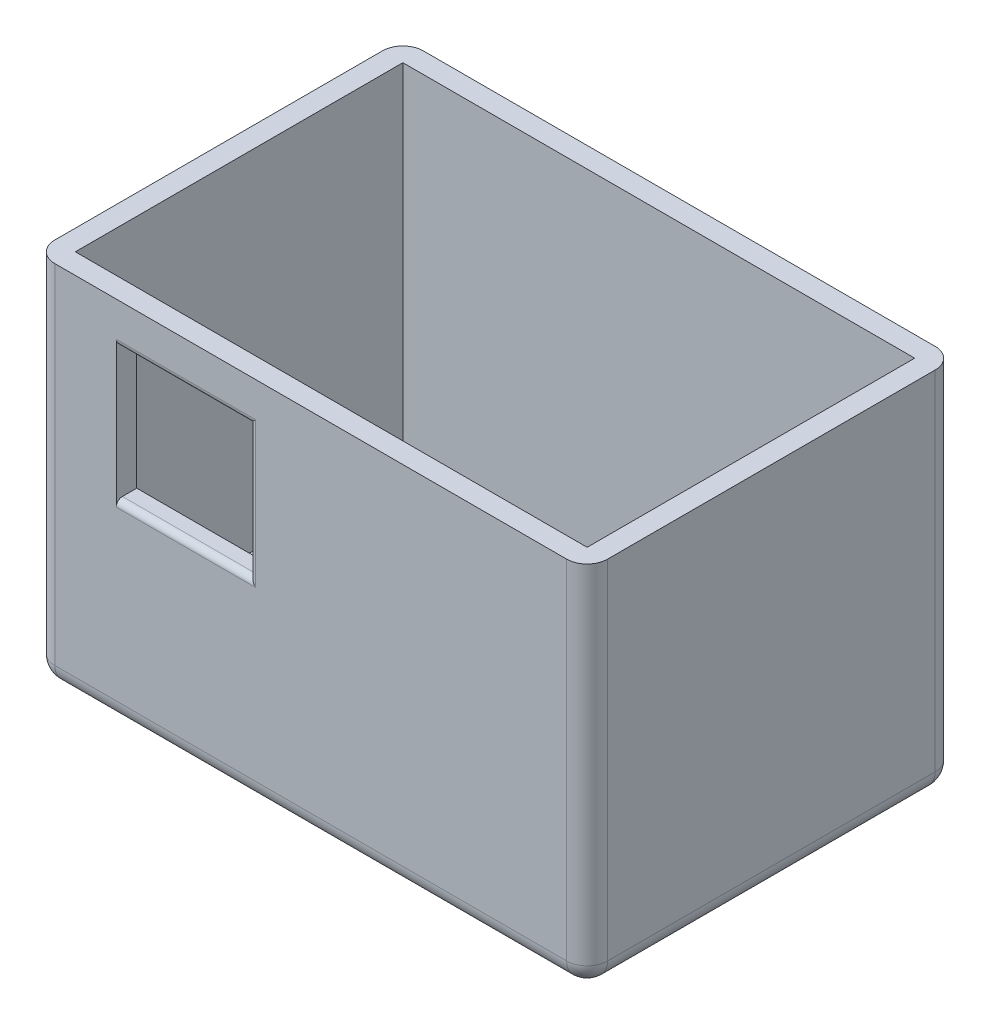
ISO-10303-21;
HEADER;
FILE_DESCRIPTION(('STEP AP214'),'2;1');
FILE_NAME('part.step','',(''),(''),'','','');
FILE_SCHEMA(('AUTOMOTIVE_DESIGN { 1 0 10303 214 1 1 1 1 }'));
ENDSEC;
DATA;
#1=APPLICATION_CONTEXT('core data for automotive mechanical design processes');
#2=APPLICATION_PROTOCOL_DEFINITION('international standard','automotive_design',2000,#1);
#3=PRODUCT_CONTEXT('',#1,'mechanical');
#4=PRODUCT('Part','Part','',(#3));
#5=PRODUCT_RELATED_PRODUCT_CATEGORY('part','',(#4));
#6=PRODUCT_DEFINITION_FORMATION('','',#4);
#7=PRODUCT_DEFINITION_CONTEXT('part definition',#1,'design');
#8=PRODUCT_DEFINITION('design','',#6,#7);
#9=PRODUCT_DEFINITION_SHAPE('','',#8);
#10=(LENGTH_UNIT() NAMED_UNIT(*) SI_UNIT(.MILLI.,.METRE.));
#11=(NAMED_UNIT(*) PLANE_ANGLE_UNIT() SI_UNIT($,.RADIAN.));
#12=(NAMED_UNIT(*) SI_UNIT($,.STERADIAN.) SOLID_ANGLE_UNIT());
#13=UNCERTAINTY_MEASURE_WITH_UNIT(LENGTH_MEASURE(1.E-05),#10,'distance_accuracy_value','');
#14=(GEOMETRIC_REPRESENTATION_CONTEXT(3) GLOBAL_UNCERTAINTY_ASSIGNED_CONTEXT((#13)) GLOBAL_UNIT_ASSIGNED_CONTEXT((#10,
#11,#12)) REPRESENTATION_CONTEXT('',''));
#15=CARTESIAN_POINT('',(0.,0.,0.));
#16=DIRECTION('',(0.,0.,1.));
#17=DIRECTION('',(1.,0.,0.));
#18=AXIS2_PLACEMENT_3D('',#15,#16,#17);
#19=CARTESIAN_POINT('',(0.,180.,0.));
#20=DIRECTION('',(0.,-1.,0.));
#21=DIRECTION('',(0.,0.,-1.));
#22=AXIS2_PLACEMENT_3D('',#19,#20,#21);
#23=PLANE('',#22);
#24=DIRECTION('',(1.,0.,0.));
#25=VECTOR('',#24,1.);
#26=CARTESIAN_POINT('',(-135.,180.,90.));
#27=LINE('',#26,#25);
#28=CARTESIAN_POINT('',(-125.,180.,90.));
#29=VERTEX_POINT('',#28);
#30=CARTESIAN_POINT('',(125.,180.,90.));
#31=VERTEX_POINT('',#30);
#32=EDGE_CURVE('E274',#29,#31,#27,.T.);
#33=ORIENTED_EDGE('',*,*,#32,.T.);
#34=CARTESIAN_POINT('',(125.,180.,80.));
#35=DIRECTION('',(0.,-1.,0.));
#36=DIRECTION('',(0.,0.,-1.));
#37=AXIS2_PLACEMENT_3D('',#34,#35,#36);
#38=CIRCLE('',#37,10.);
#39=CARTESIAN_POINT('',(135.,180.,80.));
#40=VERTEX_POINT('',#39);
#41=EDGE_CURVE('E189',#31,#40,#38,.F.);
#42=ORIENTED_EDGE('',*,*,#41,.T.);
#43=DIRECTION('',(0.,0.,-1.));
#44=VECTOR('',#43,1.);
#45=CARTESIAN_POINT('',(135.,180.,90.));
#46=LINE('',#45,#44);
#47=CARTESIAN_POINT('',(135.,180.,-79.9999999999999));
#48=VERTEX_POINT('',#47);
#49=EDGE_CURVE('E264',#40,#48,#46,.T.);
#50=ORIENTED_EDGE('',*,*,#49,.T.);
#51=CARTESIAN_POINT('',(125.,180.,-80.));
#52=DIRECTION('',(0.,-1.,0.));
#53=DIRECTION('',(0.,0.,-1.));
#54=AXIS2_PLACEMENT_3D('',#51,#52,#53);
#55=CIRCLE('',#54,10.);
#56=CARTESIAN_POINT('',(125.,180.,-90.));
#57=VERTEX_POINT('',#56);
#58=EDGE_CURVE('E315',#48,#57,#55,.F.);
#59=ORIENTED_EDGE('',*,*,#58,.T.);
#60=DIRECTION('',(-1.,0.,0.));
#61=VECTOR('',#60,1.);
#62=CARTESIAN_POINT('',(-135.,180.,-90.));
#63=LINE('',#62,#61);
#64=CARTESIAN_POINT('',(-125.,180.,-90.));
#65=VERTEX_POINT('',#64);
#66=EDGE_CURVE('E267',#57,#65,#63,.T.);
#67=ORIENTED_EDGE('',*,*,#66,.T.);
#68=CARTESIAN_POINT('',(-125.,180.,-80.));
#69=DIRECTION('',(0.,-1.,0.));
#70=DIRECTION('',(0.,0.,-1.));
#71=AXIS2_PLACEMENT_3D('',#68,#69,#70);
#72=CIRCLE('',#71,10.);
#73=CARTESIAN_POINT('',(-135.,180.,-79.9999999999999));
#74=VERTEX_POINT('',#73);
#75=EDGE_CURVE('E313',#65,#74,#72,.F.);
#76=ORIENTED_EDGE('',*,*,#75,.T.);
#77=DIRECTION('',(0.,0.,1.));
#78=VECTOR('',#77,1.);
#79=CARTESIAN_POINT('',(-135.,180.,90.));
#80=LINE('',#79,#78);
#81=CARTESIAN_POINT('',(-135.,180.,80.));
#82=VERTEX_POINT('',#81);
#83=EDGE_CURVE('E271',#74,#82,#80,.T.);
#84=ORIENTED_EDGE('',*,*,#83,.T.);
#85=CARTESIAN_POINT('',(-125.,180.,80.));
#86=DIRECTION('',(0.,-1.,0.));
#87=DIRECTION('',(0.,0.,-1.));
#88=AXIS2_PLACEMENT_3D('',#85,#86,#87);
#89=CIRCLE('',#88,10.);
#90=EDGE_CURVE('E311',#82,#29,#89,.F.);
#91=ORIENTED_EDGE('',*,*,#90,.T.);
#92=EDGE_LOOP('',(#33,#42,#50,#59,#67,#76,#84,#91));
#93=FACE_BOUND('',#92,.T.);
#94=DIRECTION('',(1.,0.,0.));
#95=VECTOR('',#94,1.);
#96=CARTESIAN_POINT('',(0.,180.,80.));
#97=LINE('',#96,#95);
#98=CARTESIAN_POINT('',(-125.,180.,80.));
#99=VERTEX_POINT('',#98);
#100=CARTESIAN_POINT('',(125.,180.,80.));
#101=VERTEX_POINT('',#100);
#102=EDGE_CURVE('E252',#99,#101,#97,.T.);
#103=ORIENTED_EDGE('',*,*,#102,.F.);
#104=DIRECTION('',(0.,0.,1.));
#105=VECTOR('',#104,1.);
#106=CARTESIAN_POINT('',(-125.,180.,0.));
#107=LINE('',#106,#105);
#108=CARTESIAN_POINT('',(-125.,180.,-80.));
#109=VERTEX_POINT('',#108);
#110=EDGE_CURVE('E259',#109,#99,#107,.T.);
#111=ORIENTED_EDGE('',*,*,#110,.F.);
#112=DIRECTION('',(-1.,0.,0.));
#113=VECTOR('',#112,1.);
#114=CARTESIAN_POINT('',(0.,180.,-80.));
#115=LINE('',#114,#113);
#116=CARTESIAN_POINT('',(125.,180.,-80.));
#117=VERTEX_POINT('',#116);
#118=EDGE_CURVE('E257',#117,#109,#115,.T.);
#119=ORIENTED_EDGE('',*,*,#118,.F.);
#120=DIRECTION('',(0.,0.,-1.));
#121=VECTOR('',#120,1.);
#122=CARTESIAN_POINT('',(125.,180.,0.));
#123=LINE('',#122,#121);
#124=EDGE_CURVE('E228',#101,#117,#123,.T.);
#125=ORIENTED_EDGE('',*,*,#124,.F.);
#126=EDGE_LOOP('',(#103,#111,#119,#125));
#127=FACE_BOUND('',#126,.T.);
#128=ADVANCED_FACE('F35',(#93,#127),#23,.F.);
#129=CARTESIAN_POINT('',(135.,180.,90.));
#130=DIRECTION('',(-1.,0.,0.));
#131=DIRECTION('',(0.,0.,1.));
#132=AXIS2_PLACEMENT_3D('',#129,#130,#131);
#133=PLANE('',#132);
#134=ORIENTED_EDGE('',*,*,#49,.F.);
#135=DIRECTION('',(0.,-1.,0.));
#136=VECTOR('',#135,1.);
#137=CARTESIAN_POINT('',(135.,180.,80.));
#138=LINE('',#137,#136);
#139=CARTESIAN_POINT('',(135.,10.,80.));
#140=VERTEX_POINT('',#139);
#141=EDGE_CURVE('E303',#40,#140,#138,.T.);
#142=ORIENTED_EDGE('',*,*,#141,.T.);
#143=DIRECTION('',(0.,0.,-1.));
#144=VECTOR('',#143,1.);
#145=CARTESIAN_POINT('',(135.,10.,-90.));
#146=LINE('',#145,#144);
#147=CARTESIAN_POINT('',(135.,10.,-80.));
#148=VERTEX_POINT('',#147);
#149=EDGE_CURVE('E301',#140,#148,#146,.T.);
#150=ORIENTED_EDGE('',*,*,#149,.T.);
#151=DIRECTION('',(0.,-1.,0.));
#152=VECTOR('',#151,1.);
#153=CARTESIAN_POINT('',(135.,180.,-80.));
#154=LINE('',#153,#152);
#155=EDGE_CURVE('E299',#148,#48,#154,.F.);
#156=ORIENTED_EDGE('',*,*,#155,.T.);
#157=EDGE_LOOP('',(#134,#142,#150,#156));
#158=FACE_BOUND('',#157,.T.);
#159=ADVANCED_FACE('F366',(#158),#133,.F.);
#160=CARTESIAN_POINT('',(-135.,180.,-90.));
#161=DIRECTION('',(0.,0.,1.));
#162=DIRECTION('',(1.,0.,0.));
#163=AXIS2_PLACEMENT_3D('',#160,#161,#162);
#164=PLANE('',#163);
#165=ORIENTED_EDGE('',*,*,#66,.F.);
#166=DIRECTION('',(0.,-1.,0.));
#167=VECTOR('',#166,1.);
#168=CARTESIAN_POINT('',(125.,180.,-90.));
#169=LINE('',#168,#167);
#170=CARTESIAN_POINT('',(125.,10.,-90.));
#171=VERTEX_POINT('',#170);
#172=EDGE_CURVE('E309',#57,#171,#169,.T.);
#173=ORIENTED_EDGE('',*,*,#172,.T.);
#174=DIRECTION('',(-1.,0.,0.));
#175=VECTOR('',#174,1.);
#176=CARTESIAN_POINT('',(-135.,10.,-90.));
#177=LINE('',#176,#175);
#178=CARTESIAN_POINT('',(-125.,10.,-90.));
#179=VERTEX_POINT('',#178);
#180=EDGE_CURVE('E307',#171,#179,#177,.T.);
#181=ORIENTED_EDGE('',*,*,#180,.T.);
#182=DIRECTION('',(0.,-1.,0.));
#183=VECTOR('',#182,1.);
#184=CARTESIAN_POINT('',(-125.,180.,-90.));
#185=LINE('',#184,#183);
#186=EDGE_CURVE('E305',#179,#65,#185,.F.);
#187=ORIENTED_EDGE('',*,*,#186,.T.);
#188=EDGE_LOOP('',(#165,#173,#181,#187));
#189=FACE_BOUND('',#188,.T.);
#190=ADVANCED_FACE('F372',(#189),#164,.F.);
#191=CARTESIAN_POINT('',(-135.,180.,90.));
#192=DIRECTION('',(1.,0.,0.));
#193=DIRECTION('',(0.,0.,-1.));
#194=AXIS2_PLACEMENT_3D('',#191,#192,#193);
#195=PLANE('',#194);
#196=ORIENTED_EDGE('',*,*,#83,.F.);
#197=DIRECTION('',(0.,-1.,0.));
#198=VECTOR('',#197,1.);
#199=CARTESIAN_POINT('',(-135.,180.,-80.));
#200=LINE('',#199,#198);
#201=CARTESIAN_POINT('',(-135.,10.,-80.));
#202=VERTEX_POINT('',#201);
#203=EDGE_CURVE('E282',#74,#202,#200,.T.);
#204=ORIENTED_EDGE('',*,*,#203,.T.);
#205=DIRECTION('',(0.,0.,1.));
#206=VECTOR('',#205,1.);
#207=CARTESIAN_POINT('',(-135.,10.,90.));
#208=LINE('',#207,#206);
#209=CARTESIAN_POINT('',(-135.,10.,80.));
#210=VERTEX_POINT('',#209);
#211=EDGE_CURVE('E279',#202,#210,#208,.T.);
#212=ORIENTED_EDGE('',*,*,#211,.T.);
#213=DIRECTION('',(0.,-1.,0.));
#214=VECTOR('',#213,1.);
#215=CARTESIAN_POINT('',(-135.,180.,80.));
#216=LINE('',#215,#214);
#217=EDGE_CURVE('E277',#210,#82,#216,.F.);
#218=ORIENTED_EDGE('',*,*,#217,.T.);
#219=EDGE_LOOP('',(#196,#204,#212,#218));
#220=FACE_BOUND('',#219,.T.);
#221=ADVANCED_FACE('F387',(#220),#195,.F.);
#222=CARTESIAN_POINT('',(-135.,180.,90.));
#223=DIRECTION('',(0.,0.,-1.));
#224=DIRECTION('',(-1.,0.,0.));
#225=AXIS2_PLACEMENT_3D('',#222,#223,#224);
#226=PLANE('',#225);
#227=DIRECTION('',(1.,0.,0.));
#228=VECTOR('',#227,1.);
#229=CARTESIAN_POINT('',(-135.,92.,90.));
#230=LINE('',#229,#228);
#231=CARTESIAN_POINT('',(-27.,92.,90.));
#232=VERTEX_POINT('',#231);
#233=CARTESIAN_POINT('',(-95.,92.,90.));
#234=VERTEX_POINT('',#233);
#235=EDGE_CURVE('E211',#232,#234,#230,.F.);
#236=ORIENTED_EDGE('',*,*,#235,.T.);
#237=DIRECTION('',(0.,-1.,0.));
#238=VECTOR('',#237,1.);
#239=CARTESIAN_POINT('',(-95.,160.,90.));
#240=LINE('',#239,#238);
#241=CARTESIAN_POINT('',(-95.,163.,90.));
#242=VERTEX_POINT('',#241);
#243=EDGE_CURVE('E195',#242,#234,#240,.T.);
#244=ORIENTED_EDGE('',*,*,#243,.F.);
#245=DIRECTION('',(-1.,0.,0.));
#246=VECTOR('',#245,1.);
#247=CARTESIAN_POINT('',(-135.,163.,90.));
#248=LINE('',#247,#246);
#249=CARTESIAN_POINT('',(-27.,163.,90.));
#250=VERTEX_POINT('',#249);
#251=EDGE_CURVE('E203',#242,#250,#248,.F.);
#252=ORIENTED_EDGE('',*,*,#251,.T.);
#253=DIRECTION('',(0.,1.,0.));
#254=VECTOR('',#253,1.);
#255=CARTESIAN_POINT('',(-27.,180.,90.));
#256=LINE('',#255,#254);
#257=EDGE_CURVE('E209',#250,#232,#256,.F.);
#258=ORIENTED_EDGE('',*,*,#257,.T.);
#259=EDGE_LOOP('',(#236,#244,#252,#258));
#260=FACE_BOUND('',#259,.T.);
#261=DIRECTION('',(1.,0.,0.));
#262=VECTOR('',#261,1.);
#263=CARTESIAN_POINT('',(135.,10.,90.));
#264=LINE('',#263,#262);
#265=CARTESIAN_POINT('',(-125.,10.,90.));
#266=VERTEX_POINT('',#265);
#267=CARTESIAN_POINT('',(125.,10.,90.));
#268=VERTEX_POINT('',#267);
#269=EDGE_CURVE('E295',#266,#268,#264,.T.);
#270=ORIENTED_EDGE('',*,*,#269,.T.);
#271=DIRECTION('',(0.,-1.,0.));
#272=VECTOR('',#271,1.);
#273=CARTESIAN_POINT('',(125.,180.,90.));
#274=LINE('',#273,#272);
#275=EDGE_CURVE('E297',#268,#31,#274,.F.);
#276=ORIENTED_EDGE('',*,*,#275,.T.);
#277=ORIENTED_EDGE('',*,*,#32,.F.);
#278=DIRECTION('',(0.,-1.,0.));
#279=VECTOR('',#278,1.);
#280=CARTESIAN_POINT('',(-125.,180.,90.));
#281=LINE('',#280,#279);
#282=EDGE_CURVE('E293',#29,#266,#281,.T.);
#283=ORIENTED_EDGE('',*,*,#282,.T.);
#284=EDGE_LOOP('',(#270,#276,#277,#283));
#285=FACE_BOUND('',#284,.T.);
#286=ADVANCED_FACE('F355',(#260,#285),#226,.F.);
#287=CARTESIAN_POINT('',(0.,0.,0.));
#288=DIRECTION('',(0.,-1.,0.));
#289=DIRECTION('',(0.,0.,-1.));
#290=AXIS2_PLACEMENT_3D('',#287,#288,#289);
#291=PLANE('',#290);
#292=DIRECTION('',(1.,0.,0.));
#293=VECTOR('',#292,1.);
#294=CARTESIAN_POINT('',(-135.,0.,80.));
#295=LINE('',#294,#293);
#296=CARTESIAN_POINT('',(125.,0.,80.));
#297=VERTEX_POINT('',#296);
#298=CARTESIAN_POINT('',(-125.,0.,80.));
#299=VERTEX_POINT('',#298);
#300=EDGE_CURVE('E288',#297,#299,#295,.F.);
#301=ORIENTED_EDGE('',*,*,#300,.T.);
#302=DIRECTION('',(0.,0.,1.));
#303=VECTOR('',#302,1.);
#304=CARTESIAN_POINT('',(-125.,0.,-90.));
#305=LINE('',#304,#303);
#306=CARTESIAN_POINT('',(-125.,0.,-80.));
#307=VERTEX_POINT('',#306);
#308=EDGE_CURVE('E290',#299,#307,#305,.F.);
#309=ORIENTED_EDGE('',*,*,#308,.T.);
#310=DIRECTION('',(-1.,0.,0.));
#311=VECTOR('',#310,1.);
#312=CARTESIAN_POINT('',(135.,0.,-80.));
#313=LINE('',#312,#311);
#314=CARTESIAN_POINT('',(125.,0.,-80.));
#315=VERTEX_POINT('',#314);
#316=EDGE_CURVE('E284',#307,#315,#313,.F.);
#317=ORIENTED_EDGE('',*,*,#316,.T.);
#318=DIRECTION('',(0.,0.,-1.));
#319=VECTOR('',#318,1.);
#320=CARTESIAN_POINT('',(125.,0.,90.));
#321=LINE('',#320,#319);
#322=EDGE_CURVE('E286',#315,#297,#321,.F.);
#323=ORIENTED_EDGE('',*,*,#322,.T.);
#324=EDGE_LOOP('',(#301,#309,#317,#323));
#325=FACE_BOUND('',#324,.T.);
#326=ADVANCED_FACE('F380',(#325),#291,.T.);
#327=CARTESIAN_POINT('',(125.,180.,-80.));
#328=DIRECTION('',(0.,-1.,0.));
#329=DIRECTION('',(0.,0.,-1.));
#330=AXIS2_PLACEMENT_3D('',#327,#328,#329);
#331=CYLINDRICAL_SURFACE('',#330,10.);
#332=ORIENTED_EDGE('',*,*,#58,.F.);
#333=ORIENTED_EDGE('',*,*,#155,.F.);
#334=CARTESIAN_POINT('',(125.,10.,-80.));
#335=DIRECTION('',(0.,-1.,0.));
#336=DIRECTION('',(0.,0.,-1.));
#337=AXIS2_PLACEMENT_3D('',#334,#335,#336);
#338=CIRCLE('',#337,10.);
#339=EDGE_CURVE('E345',#171,#148,#338,.T.);
#340=ORIENTED_EDGE('',*,*,#339,.F.);
#341=ORIENTED_EDGE('',*,*,#172,.F.);
#342=EDGE_LOOP('',(#332,#333,#340,#341));
#343=FACE_BOUND('',#342,.T.);
#344=ADVANCED_FACE('F383',(#343),#331,.T.);
#345=CARTESIAN_POINT('',(125.,180.,80.));
#346=DIRECTION('',(0.,-1.,0.));
#347=DIRECTION('',(0.,0.,-1.));
#348=AXIS2_PLACEMENT_3D('',#345,#346,#347);
#349=CYLINDRICAL_SURFACE('',#348,10.);
#350=ORIENTED_EDGE('',*,*,#41,.F.);
#351=ORIENTED_EDGE('',*,*,#275,.F.);
#352=CARTESIAN_POINT('',(125.,10.,80.));
#353=DIRECTION('',(0.,-1.,0.));
#354=DIRECTION('',(0.,0.,-1.));
#355=AXIS2_PLACEMENT_3D('',#352,#353,#354);
#356=CIRCLE('',#355,10.);
#357=EDGE_CURVE('E342',#140,#268,#356,.T.);
#358=ORIENTED_EDGE('',*,*,#357,.F.);
#359=ORIENTED_EDGE('',*,*,#141,.F.);
#360=EDGE_LOOP('',(#350,#351,#358,#359));
#361=FACE_BOUND('',#360,.T.);
#362=ADVANCED_FACE('F434',(#361),#349,.T.);
#363=CARTESIAN_POINT('',(125.,10.,90.));
#364=DIRECTION('',(0.,0.,1.));
#365=DIRECTION('',(1.,0.,0.));
#366=AXIS2_PLACEMENT_3D('',#363,#364,#365);
#367=CYLINDRICAL_SURFACE('',#366,10.);
#368=CARTESIAN_POINT('',(125.,10.,-80.));
#369=DIRECTION('',(0.,0.,-1.));
#370=DIRECTION('',(-1.,0.,0.));
#371=AXIS2_PLACEMENT_3D('',#368,#369,#370);
#372=CIRCLE('',#371,10.);
#373=EDGE_CURVE('E268',#148,#315,#372,.T.);
#374=ORIENTED_EDGE('',*,*,#373,.F.);
#375=ORIENTED_EDGE('',*,*,#149,.F.);
#376=CARTESIAN_POINT('',(125.,10.,80.));
#377=DIRECTION('',(0.,0.,1.));
#378=DIRECTION('',(1.,0.,0.));
#379=AXIS2_PLACEMENT_3D('',#376,#377,#378);
#380=CIRCLE('',#379,10.);
#381=EDGE_CURVE('E339',#297,#140,#380,.T.);
#382=ORIENTED_EDGE('',*,*,#381,.F.);
#383=ORIENTED_EDGE('',*,*,#322,.F.);
#384=EDGE_LOOP('',(#374,#375,#382,#383));
#385=FACE_BOUND('',#384,.T.);
#386=ADVANCED_FACE('F430',(#385),#367,.T.);
#387=CARTESIAN_POINT('',(125.,10.,-80.));
#388=DIRECTION('',(0.,0.,1.));
#389=DIRECTION('',(1.,0.,0.));
#390=AXIS2_PLACEMENT_3D('',#387,#388,#389);
#391=SPHERICAL_SURFACE('',#390,10.);
#392=ORIENTED_EDGE('',*,*,#339,.T.);
#393=ORIENTED_EDGE('',*,*,#373,.T.);
#394=CARTESIAN_POINT('',(125.,10.,-80.));
#395=DIRECTION('',(1.,0.,0.));
#396=DIRECTION('',(0.,0.,-1.));
#397=AXIS2_PLACEMENT_3D('',#394,#395,#396);
#398=CIRCLE('',#397,10.);
#399=EDGE_CURVE('E336',#171,#315,#398,.F.);
#400=ORIENTED_EDGE('',*,*,#399,.F.);
#401=EDGE_LOOP('',(#392,#393,#400));
#402=FACE_BOUND('',#401,.T.);
#403=ADVANCED_FACE('F426',(#402),#391,.T.);
#404=CARTESIAN_POINT('',(125.,10.,80.));
#405=DIRECTION('',(0.,0.,1.));
#406=DIRECTION('',(1.,0.,0.));
#407=AXIS2_PLACEMENT_3D('',#404,#405,#406);
#408=SPHERICAL_SURFACE('',#407,10.);
#409=ORIENTED_EDGE('',*,*,#381,.T.);
#410=ORIENTED_EDGE('',*,*,#357,.T.);
#411=CARTESIAN_POINT('',(125.,10.,80.));
#412=DIRECTION('',(1.,0.,0.));
#413=DIRECTION('',(0.,0.,-1.));
#414=AXIS2_PLACEMENT_3D('',#411,#412,#413);
#415=CIRCLE('',#414,10.);
#416=EDGE_CURVE('E333',#297,#268,#415,.F.);
#417=ORIENTED_EDGE('',*,*,#416,.F.);
#418=EDGE_LOOP('',(#409,#410,#417));
#419=FACE_BOUND('',#418,.T.);
#420=ADVANCED_FACE('F422',(#419),#408,.T.);
#421=CARTESIAN_POINT('',(-135.,10.,-80.));
#422=DIRECTION('',(1.,0.,0.));
#423=DIRECTION('',(0.,0.,-1.));
#424=AXIS2_PLACEMENT_3D('',#421,#422,#423);
#425=CYLINDRICAL_SURFACE('',#424,10.);
#426=ORIENTED_EDGE('',*,*,#399,.T.);
#427=ORIENTED_EDGE('',*,*,#316,.F.);
#428=CARTESIAN_POINT('',(-125.,10.,-80.));
#429=DIRECTION('',(-1.,0.,0.));
#430=DIRECTION('',(0.,0.,1.));
#431=AXIS2_PLACEMENT_3D('',#428,#429,#430);
#432=CIRCLE('',#431,10.);
#433=EDGE_CURVE('E330',#179,#307,#432,.T.);
#434=ORIENTED_EDGE('',*,*,#433,.F.);
#435=ORIENTED_EDGE('',*,*,#180,.F.);
#436=EDGE_LOOP('',(#426,#427,#434,#435));
#437=FACE_BOUND('',#436,.T.);
#438=ADVANCED_FACE('F418',(#437),#425,.T.);
#439=CARTESIAN_POINT('',(-125.,180.,-80.));
#440=DIRECTION('',(0.,-1.,0.));
#441=DIRECTION('',(0.,0.,-1.));
#442=AXIS2_PLACEMENT_3D('',#439,#440,#441);
#443=CYLINDRICAL_SURFACE('',#442,10.);
#444=ORIENTED_EDGE('',*,*,#75,.F.);
#445=ORIENTED_EDGE('',*,*,#186,.F.);
#446=CARTESIAN_POINT('',(-125.,10.,-80.));
#447=DIRECTION('',(0.,-1.,0.));
#448=DIRECTION('',(0.,0.,-1.));
#449=AXIS2_PLACEMENT_3D('',#446,#447,#448);
#450=CIRCLE('',#449,10.);
#451=EDGE_CURVE('E327',#202,#179,#450,.T.);
#452=ORIENTED_EDGE('',*,*,#451,.F.);
#453=ORIENTED_EDGE('',*,*,#203,.F.);
#454=EDGE_LOOP('',(#444,#445,#452,#453));
#455=FACE_BOUND('',#454,.T.);
#456=ADVANCED_FACE('F414',(#455),#443,.T.);
#457=CARTESIAN_POINT('',(-125.,180.,80.));
#458=DIRECTION('',(0.,-1.,0.));
#459=DIRECTION('',(0.,0.,-1.));
#460=AXIS2_PLACEMENT_3D('',#457,#458,#459);
#461=CYLINDRICAL_SURFACE('',#460,10.);
#462=ORIENTED_EDGE('',*,*,#90,.F.);
#463=ORIENTED_EDGE('',*,*,#217,.F.);
#464=CARTESIAN_POINT('',(-125.,10.,80.));
#465=DIRECTION('',(0.,-1.,0.));
#466=DIRECTION('',(0.,0.,-1.));
#467=AXIS2_PLACEMENT_3D('',#464,#465,#466);
#468=CIRCLE('',#467,10.);
#469=EDGE_CURVE('E324',#266,#210,#468,.T.);
#470=ORIENTED_EDGE('',*,*,#469,.F.);
#471=ORIENTED_EDGE('',*,*,#282,.F.);
#472=EDGE_LOOP('',(#462,#463,#470,#471));
#473=FACE_BOUND('',#472,.T.);
#474=ADVANCED_FACE('F410',(#473),#461,.T.);
#475=CARTESIAN_POINT('',(-135.,10.,80.));
#476=DIRECTION('',(-1.,0.,0.));
#477=DIRECTION('',(0.,0.,1.));
#478=AXIS2_PLACEMENT_3D('',#475,#476,#477);
#479=CYLINDRICAL_SURFACE('',#478,10.);
#480=ORIENTED_EDGE('',*,*,#416,.T.);
#481=ORIENTED_EDGE('',*,*,#269,.F.);
#482=CARTESIAN_POINT('',(-125.,10.,80.));
#483=DIRECTION('',(-1.,0.,0.));
#484=DIRECTION('',(0.,0.,1.));
#485=AXIS2_PLACEMENT_3D('',#482,#483,#484);
#486=CIRCLE('',#485,10.);
#487=EDGE_CURVE('E321',#299,#266,#486,.T.);
#488=ORIENTED_EDGE('',*,*,#487,.F.);
#489=ORIENTED_EDGE('',*,*,#300,.F.);
#490=EDGE_LOOP('',(#480,#481,#488,#489));
#491=FACE_BOUND('',#490,.T.);
#492=ADVANCED_FACE('F406',(#491),#479,.T.);
#493=CARTESIAN_POINT('',(-125.,10.,-80.));
#494=DIRECTION('',(0.,0.,1.));
#495=DIRECTION('',(1.,0.,0.));
#496=AXIS2_PLACEMENT_3D('',#493,#494,#495);
#497=SPHERICAL_SURFACE('',#496,10.);
#498=ORIENTED_EDGE('',*,*,#451,.T.);
#499=ORIENTED_EDGE('',*,*,#433,.T.);
#500=CARTESIAN_POINT('',(-125.,10.,-80.));
#501=DIRECTION('',(0.,0.,-1.));
#502=DIRECTION('',(-1.,0.,0.));
#503=AXIS2_PLACEMENT_3D('',#500,#501,#502);
#504=CIRCLE('',#503,10.);
#505=EDGE_CURVE('E319',#202,#307,#504,.F.);
#506=ORIENTED_EDGE('',*,*,#505,.F.);
#507=EDGE_LOOP('',(#498,#499,#506));
#508=FACE_BOUND('',#507,.T.);
#509=ADVANCED_FACE('F402',(#508),#497,.T.);
#510=CARTESIAN_POINT('',(-125.,10.,80.));
#511=DIRECTION('',(0.,0.,1.));
#512=DIRECTION('',(1.,0.,0.));
#513=AXIS2_PLACEMENT_3D('',#510,#511,#512);
#514=SPHERICAL_SURFACE('',#513,10.);
#515=ORIENTED_EDGE('',*,*,#487,.T.);
#516=ORIENTED_EDGE('',*,*,#469,.T.);
#517=CARTESIAN_POINT('',(-125.,10.,80.));
#518=DIRECTION('',(0.,0.,1.));
#519=DIRECTION('',(1.,0.,0.));
#520=AXIS2_PLACEMENT_3D('',#517,#518,#519);
#521=CIRCLE('',#520,10.);
#522=EDGE_CURVE('E248',#299,#210,#521,.F.);
#523=ORIENTED_EDGE('',*,*,#522,.F.);
#524=EDGE_LOOP('',(#515,#516,#523));
#525=FACE_BOUND('',#524,.T.);
#526=ADVANCED_FACE('F398',(#525),#514,.T.);
#527=CARTESIAN_POINT('',(-125.,10.,90.));
#528=DIRECTION('',(0.,0.,-1.));
#529=DIRECTION('',(-1.,0.,0.));
#530=AXIS2_PLACEMENT_3D('',#527,#528,#529);
#531=CYLINDRICAL_SURFACE('',#530,10.);
#532=ORIENTED_EDGE('',*,*,#505,.T.);
#533=ORIENTED_EDGE('',*,*,#308,.F.);
#534=ORIENTED_EDGE('',*,*,#522,.T.);
#535=ORIENTED_EDGE('',*,*,#211,.F.);
#536=EDGE_LOOP('',(#532,#533,#534,#535));
#537=FACE_BOUND('',#536,.T.);
#538=ADVANCED_FACE('F394',(#537),#531,.T.);
#539=CARTESIAN_POINT('',(125.,180.,90.));
#540=DIRECTION('',(-1.,0.,0.));
#541=DIRECTION('',(0.,0.,1.));
#542=AXIS2_PLACEMENT_3D('',#539,#540,#541);
#543=PLANE('',#542);
#544=ORIENTED_EDGE('',*,*,#124,.T.);
#545=DIRECTION('',(0.,1.,0.));
#546=VECTOR('',#545,1.);
#547=CARTESIAN_POINT('',(125.,180.,-80.));
#548=LINE('',#547,#546);
#549=CARTESIAN_POINT('',(125.,10.,-80.));
#550=VERTEX_POINT('',#549);
#551=EDGE_CURVE('E234',#550,#117,#548,.T.);
#552=ORIENTED_EDGE('',*,*,#551,.F.);
#553=DIRECTION('',(0.,0.,-1.));
#554=VECTOR('',#553,1.);
#555=CARTESIAN_POINT('',(125.,10.,0.));
#556=LINE('',#555,#554);
#557=CARTESIAN_POINT('',(125.,10.,80.));
#558=VERTEX_POINT('',#557);
#559=EDGE_CURVE('E236',#558,#550,#556,.T.);
#560=ORIENTED_EDGE('',*,*,#559,.F.);
#561=DIRECTION('',(0.,1.,0.));
#562=VECTOR('',#561,1.);
#563=CARTESIAN_POINT('',(125.,180.,80.));
#564=LINE('',#563,#562);
#565=EDGE_CURVE('E232',#558,#101,#564,.T.);
#566=ORIENTED_EDGE('',*,*,#565,.T.);
#567=EDGE_LOOP('',(#544,#552,#560,#566));
#568=FACE_BOUND('',#567,.T.);
#569=ADVANCED_FACE('F397',(#568),#543,.T.);
#570=CARTESIAN_POINT('',(-135.,180.,-80.));
#571=DIRECTION('',(0.,0.,1.));
#572=DIRECTION('',(1.,0.,0.));
#573=AXIS2_PLACEMENT_3D('',#570,#571,#572);
#574=PLANE('',#573);
#575=ORIENTED_EDGE('',*,*,#118,.T.);
#576=DIRECTION('',(0.,1.,0.));
#577=VECTOR('',#576,1.);
#578=CARTESIAN_POINT('',(-125.,180.,-80.));
#579=LINE('',#578,#577);
#580=CARTESIAN_POINT('',(-125.,10.,-80.));
#581=VERTEX_POINT('',#580);
#582=EDGE_CURVE('E239',#581,#109,#579,.T.);
#583=ORIENTED_EDGE('',*,*,#582,.F.);
#584=DIRECTION('',(1.,0.,0.));
#585=VECTOR('',#584,1.);
#586=CARTESIAN_POINT('',(-135.,10.,-80.));
#587=LINE('',#586,#585);
#588=EDGE_CURVE('E241',#581,#550,#587,.T.);
#589=ORIENTED_EDGE('',*,*,#588,.T.);
#590=ORIENTED_EDGE('',*,*,#551,.T.);
#591=EDGE_LOOP('',(#575,#583,#589,#590));
#592=FACE_BOUND('',#591,.T.);
#593=ADVANCED_FACE('F531',(#592),#574,.T.);
#594=CARTESIAN_POINT('',(-125.,180.,90.));
#595=DIRECTION('',(1.,0.,0.));
#596=DIRECTION('',(0.,0.,-1.));
#597=AXIS2_PLACEMENT_3D('',#594,#595,#596);
#598=PLANE('',#597);
#599=ORIENTED_EDGE('',*,*,#110,.T.);
#600=DIRECTION('',(0.,1.,0.));
#601=VECTOR('',#600,1.);
#602=CARTESIAN_POINT('',(-125.,180.,80.));
#603=LINE('',#602,#601);
#604=CARTESIAN_POINT('',(-125.,10.,80.));
#605=VERTEX_POINT('',#604);
#606=EDGE_CURVE('E245',#605,#99,#603,.T.);
#607=ORIENTED_EDGE('',*,*,#606,.F.);
#608=DIRECTION('',(0.,0.,-1.));
#609=VECTOR('',#608,1.);
#610=CARTESIAN_POINT('',(-125.,10.,90.));
#611=LINE('',#610,#609);
#612=EDGE_CURVE('E244',#605,#581,#611,.T.);
#613=ORIENTED_EDGE('',*,*,#612,.T.);
#614=ORIENTED_EDGE('',*,*,#582,.T.);
#615=EDGE_LOOP('',(#599,#607,#613,#614));
#616=FACE_BOUND('',#615,.T.);
#617=ADVANCED_FACE('F539',(#616),#598,.T.);
#618=CARTESIAN_POINT('',(-135.,180.,80.));
#619=DIRECTION('',(0.,0.,-1.));
#620=DIRECTION('',(-1.,0.,0.));
#621=AXIS2_PLACEMENT_3D('',#618,#619,#620);
#622=PLANE('',#621);
#623=DIRECTION('',(0.,1.,0.));
#624=VECTOR('',#623,1.);
#625=CARTESIAN_POINT('',(-95.,180.,80.));
#626=LINE('',#625,#624);
#627=CARTESIAN_POINT('',(-95.,95.,80.));
#628=VERTEX_POINT('',#627);
#629=CARTESIAN_POINT('',(-95.,160.,80.));
#630=VERTEX_POINT('',#629);
#631=EDGE_CURVE('E193',#628,#630,#626,.T.);
#632=ORIENTED_EDGE('',*,*,#631,.F.);
#633=DIRECTION('',(-1.,0.,0.));
#634=VECTOR('',#633,1.);
#635=CARTESIAN_POINT('',(-135.,95.,80.));
#636=LINE('',#635,#634);
#637=CARTESIAN_POINT('',(-30.,95.,80.));
#638=VERTEX_POINT('',#637);
#639=EDGE_CURVE('E177',#638,#628,#636,.T.);
#640=ORIENTED_EDGE('',*,*,#639,.F.);
#641=DIRECTION('',(0.,-1.,0.));
#642=VECTOR('',#641,1.);
#643=CARTESIAN_POINT('',(-30.,180.,80.));
#644=LINE('',#643,#642);
#645=CARTESIAN_POINT('',(-30.,160.,80.));
#646=VERTEX_POINT('',#645);
#647=EDGE_CURVE('E188',#646,#638,#644,.T.);
#648=ORIENTED_EDGE('',*,*,#647,.F.);
#649=DIRECTION('',(1.,0.,0.));
#650=VECTOR('',#649,1.);
#651=CARTESIAN_POINT('',(-135.,160.,80.));
#652=LINE('',#651,#650);
#653=EDGE_CURVE('E200',#630,#646,#652,.T.);
#654=ORIENTED_EDGE('',*,*,#653,.F.);
#655=EDGE_LOOP('',(#632,#640,#648,#654));
#656=FACE_BOUND('',#655,.T.);
#657=DIRECTION('',(1.,0.,0.));
#658=VECTOR('',#657,1.);
#659=CARTESIAN_POINT('',(0.,10.,80.));
#660=LINE('',#659,#658);
#661=EDGE_CURVE('E235',#605,#558,#660,.T.);
#662=ORIENTED_EDGE('',*,*,#661,.F.);
#663=ORIENTED_EDGE('',*,*,#606,.T.);
#664=ORIENTED_EDGE('',*,*,#102,.T.);
#665=ORIENTED_EDGE('',*,*,#565,.F.);
#666=EDGE_LOOP('',(#662,#663,#664,#665));
#667=FACE_BOUND('',#666,.T.);
#668=ADVANCED_FACE('F198',(#656,#667),#622,.T.);
#669=CARTESIAN_POINT('',(0.,10.,0.));
#670=DIRECTION('',(0.,-1.,0.));
#671=DIRECTION('',(0.,0.,-1.));
#672=AXIS2_PLACEMENT_3D('',#669,#670,#671);
#673=PLANE('',#672);
#674=ORIENTED_EDGE('',*,*,#661,.T.);
#675=ORIENTED_EDGE('',*,*,#559,.T.);
#676=ORIENTED_EDGE('',*,*,#588,.F.);
#677=ORIENTED_EDGE('',*,*,#612,.F.);
#678=EDGE_LOOP('',(#674,#675,#676,#677));
#679=FACE_BOUND('',#678,.T.);
#680=ADVANCED_FACE('F378',(#679),#673,.F.);
#681=CARTESIAN_POINT('',(-95.,160.,70.));
#682=DIRECTION('',(-1.,0.,0.));
#683=DIRECTION('',(0.,0.,1.));
#684=AXIS2_PLACEMENT_3D('',#681,#682,#683);
#685=PLANE('',#684);
#686=ORIENTED_EDGE('',*,*,#631,.T.);
#687=DIRECTION('',(0.,0.,1.));
#688=VECTOR('',#687,1.);
#689=CARTESIAN_POINT('',(-95.,160.,70.));
#690=LINE('',#689,#688);
#691=CARTESIAN_POINT('',(-95.,160.,87.));
#692=VERTEX_POINT('',#691);
#693=EDGE_CURVE('E226',#630,#692,#690,.T.);
#694=ORIENTED_EDGE('',*,*,#693,.T.);
#695=CARTESIAN_POINT('',(-95.,163.,87.));
#696=DIRECTION('',(-1.,0.,0.));
#697=DIRECTION('',(0.,0.,1.));
#698=AXIS2_PLACEMENT_3D('',#695,#696,#697);
#699=CIRCLE('',#698,3.);
#700=EDGE_CURVE('E11',#692,#242,#699,.T.);
#701=ORIENTED_EDGE('',*,*,#700,.T.);
#702=ORIENTED_EDGE('',*,*,#243,.T.);
#703=CARTESIAN_POINT('',(-95.,92.,87.));
#704=DIRECTION('',(-1.,0.,0.));
#705=DIRECTION('',(0.,0.,1.));
#706=AXIS2_PLACEMENT_3D('',#703,#704,#705);
#707=CIRCLE('',#706,3.);
#708=CARTESIAN_POINT('',(-95.,95.,87.));
#709=VERTEX_POINT('',#708);
#710=EDGE_CURVE('E44',#234,#709,#707,.T.);
#711=ORIENTED_EDGE('',*,*,#710,.T.);
#712=DIRECTION('',(0.,0.,1.));
#713=VECTOR('',#712,1.);
#714=CARTESIAN_POINT('',(-95.,95.,70.));
#715=LINE('',#714,#713);
#716=EDGE_CURVE('E181',#628,#709,#715,.T.);
#717=ORIENTED_EDGE('',*,*,#716,.F.);
#718=EDGE_LOOP('',(#686,#694,#701,#702,#711,#717));
#719=FACE_BOUND('',#718,.T.);
#720=ADVANCED_FACE('F192',(#719),#685,.F.);
#721=CARTESIAN_POINT('',(-95.,160.,70.));
#722=DIRECTION('',(0.,1.,0.));
#723=DIRECTION('',(0.,0.,1.));
#724=AXIS2_PLACEMENT_3D('',#721,#722,#723);
#725=PLANE('',#724);
#726=DIRECTION('',(0.,0.,1.));
#727=VECTOR('',#726,1.);
#728=CARTESIAN_POINT('',(-30.,160.,70.));
#729=LINE('',#728,#727);
#730=CARTESIAN_POINT('',(-30.,160.,87.));
#731=VERTEX_POINT('',#730);
#732=EDGE_CURVE('E229',#646,#731,#729,.T.);
#733=ORIENTED_EDGE('',*,*,#732,.T.);
#734=DIRECTION('',(-1.,0.,0.));
#735=VECTOR('',#734,1.);
#736=CARTESIAN_POINT('',(-95.,160.,87.));
#737=LINE('',#736,#735);
#738=EDGE_CURVE('E52',#731,#692,#737,.T.);
#739=ORIENTED_EDGE('',*,*,#738,.T.);
#740=ORIENTED_EDGE('',*,*,#693,.F.);
#741=ORIENTED_EDGE('',*,*,#653,.T.);
#742=EDGE_LOOP('',(#733,#739,#740,#741));
#743=FACE_BOUND('',#742,.T.);
#744=ADVANCED_FACE('F350',(#743),#725,.F.);
#745=CARTESIAN_POINT('',(-30.,160.,70.));
#746=DIRECTION('',(1.,0.,0.));
#747=DIRECTION('',(0.,1.,0.));
#748=AXIS2_PLACEMENT_3D('',#745,#746,#747);
#749=PLANE('',#748);
#750=DIRECTION('',(0.,0.,1.));
#751=VECTOR('',#750,1.);
#752=CARTESIAN_POINT('',(-30.,95.,70.));
#753=LINE('',#752,#751);
#754=CARTESIAN_POINT('',(-30.,95.,87.));
#755=VERTEX_POINT('',#754);
#756=EDGE_CURVE('E183',#638,#755,#753,.T.);
#757=ORIENTED_EDGE('',*,*,#756,.T.);
#758=DIRECTION('',(0.,1.,0.));
#759=VECTOR('',#758,1.);
#760=CARTESIAN_POINT('',(-30.,160.,87.));
#761=LINE('',#760,#759);
#762=EDGE_CURVE('E60',#755,#731,#761,.T.);
#763=ORIENTED_EDGE('',*,*,#762,.T.);
#764=ORIENTED_EDGE('',*,*,#732,.F.);
#765=ORIENTED_EDGE('',*,*,#647,.T.);
#766=EDGE_LOOP('',(#757,#763,#764,#765));
#767=FACE_BOUND('',#766,.T.);
#768=ADVANCED_FACE('F349',(#767),#749,.F.);
#769=CARTESIAN_POINT('',(-95.,95.,70.));
#770=DIRECTION('',(0.,-1.,0.));
#771=DIRECTION('',(0.,0.,-1.));
#772=AXIS2_PLACEMENT_3D('',#769,#770,#771);
#773=PLANE('',#772);
#774=ORIENTED_EDGE('',*,*,#716,.T.);
#775=DIRECTION('',(1.,0.,0.));
#776=VECTOR('',#775,1.);
#777=CARTESIAN_POINT('',(-95.,95.,87.));
#778=LINE('',#777,#776);
#779=EDGE_CURVE('E201',#709,#755,#778,.T.);
#780=ORIENTED_EDGE('',*,*,#779,.T.);
#781=ORIENTED_EDGE('',*,*,#756,.F.);
#782=ORIENTED_EDGE('',*,*,#639,.T.);
#783=EDGE_LOOP('',(#774,#780,#781,#782));
#784=FACE_BOUND('',#783,.T.);
#785=ADVANCED_FACE('F179',(#784),#773,.F.);
#786=CARTESIAN_POINT('',(-95.,163.,87.));
#787=DIRECTION('',(-1.,0.,0.));
#788=DIRECTION('',(0.,0.,1.));
#789=AXIS2_PLACEMENT_3D('',#786,#787,#788);
#790=CYLINDRICAL_SURFACE('',#789,3.);
#791=ORIENTED_EDGE('',*,*,#700,.F.);
#792=ORIENTED_EDGE('',*,*,#738,.F.);
#793=CARTESIAN_POINT('',(-27.,163.,87.));
#794=DIRECTION('',(-0.707106781186548,0.707106781186547,0.));
#795=DIRECTION('',(0.707106781186547,0.707106781186548,0.));
#796=AXIS2_PLACEMENT_3D('',#793,#794,#795);
#797=ELLIPSE('',#796,4.24264068711928,3.);
#798=EDGE_CURVE('E39',#250,#731,#797,.F.);
#799=ORIENTED_EDGE('',*,*,#798,.F.);
#800=ORIENTED_EDGE('',*,*,#251,.F.);
#801=EDGE_LOOP('',(#791,#792,#799,#800));
#802=FACE_BOUND('',#801,.T.);
#803=ADVANCED_FACE('F37',(#802),#790,.T.);
#804=CARTESIAN_POINT('',(-27.,160.,87.));
#805=DIRECTION('',(0.,1.,0.));
#806=DIRECTION('',(-1.,0.,0.));
#807=AXIS2_PLACEMENT_3D('',#804,#805,#806);
#808=CYLINDRICAL_SURFACE('',#807,3.);
#809=ORIENTED_EDGE('',*,*,#798,.T.);
#810=ORIENTED_EDGE('',*,*,#762,.F.);
#811=CARTESIAN_POINT('',(-27.,92.,87.));
#812=DIRECTION('',(0.707106781186547,0.707106781186548,0.));
#813=DIRECTION('',(0.707106781186548,-0.707106781186547,0.));
#814=AXIS2_PLACEMENT_3D('',#811,#812,#813);
#815=ELLIPSE('',#814,4.24264068711929,3.);
#816=EDGE_CURVE('E216',#232,#755,#815,.F.);
#817=ORIENTED_EDGE('',*,*,#816,.F.);
#818=ORIENTED_EDGE('',*,*,#257,.F.);
#819=EDGE_LOOP('',(#809,#810,#817,#818));
#820=FACE_BOUND('',#819,.T.);
#821=ADVANCED_FACE('F359',(#820),#808,.T.);
#822=CARTESIAN_POINT('',(-95.,92.,87.));
#823=DIRECTION('',(1.,0.,0.));
#824=DIRECTION('',(0.,0.,-1.));
#825=AXIS2_PLACEMENT_3D('',#822,#823,#824);
#826=CYLINDRICAL_SURFACE('',#825,3.);
#827=ORIENTED_EDGE('',*,*,#710,.F.);
#828=ORIENTED_EDGE('',*,*,#235,.F.);
#829=ORIENTED_EDGE('',*,*,#816,.T.);
#830=ORIENTED_EDGE('',*,*,#779,.F.);
#831=EDGE_LOOP('',(#827,#828,#829,#830));
#832=FACE_BOUND('',#831,.T.);
#833=ADVANCED_FACE('F357',(#832),#826,.T.);
#834=CLOSED_SHELL('',(#128,#159,#190,#221,#286,#326,#344,#362,#386,#403,#420,#438,#456,#474,
#492,#509,#526,#538,#569,#593,#617,#668,#680,#720,#744,#768,#785,#803,#821,#833));
#835=MANIFOLD_SOLID_BREP('B2',#834);
#836=ADVANCED_BREP_SHAPE_REPRESENTATION('',(#18,#835),#14);
#837=SHAPE_DEFINITION_REPRESENTATION(#9,#836);
ENDSEC;
END-ISO-10303-21;
